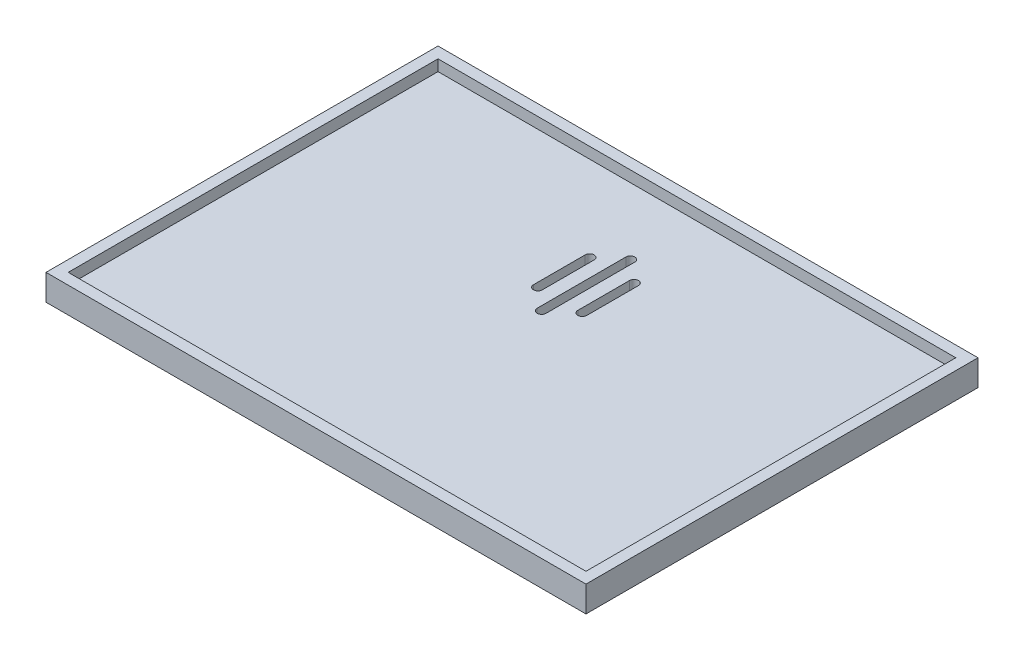
ISO-10303-21;
HEADER;
FILE_DESCRIPTION(('STEP AP214'),'2;1');
FILE_NAME('part.step','',(''),(''),'','','');
FILE_SCHEMA(('AUTOMOTIVE_DESIGN { 1 0 10303 214 1 1 1 1 }'));
ENDSEC;
DATA;
#1=APPLICATION_CONTEXT('core data for automotive mechanical design processes');
#2=APPLICATION_PROTOCOL_DEFINITION('international standard','automotive_design',2000,#1);
#3=PRODUCT_CONTEXT('',#1,'mechanical');
#4=PRODUCT('Part','Part','',(#3));
#5=PRODUCT_RELATED_PRODUCT_CATEGORY('part','',(#4));
#6=PRODUCT_DEFINITION_FORMATION('','',#4);
#7=PRODUCT_DEFINITION_CONTEXT('part definition',#1,'design');
#8=PRODUCT_DEFINITION('design','',#6,#7);
#9=PRODUCT_DEFINITION_SHAPE('','',#8);
#10=(LENGTH_UNIT() NAMED_UNIT(*) SI_UNIT(.MILLI.,.METRE.));
#11=(NAMED_UNIT(*) PLANE_ANGLE_UNIT() SI_UNIT($,.RADIAN.));
#12=(NAMED_UNIT(*) SI_UNIT($,.STERADIAN.) SOLID_ANGLE_UNIT());
#13=UNCERTAINTY_MEASURE_WITH_UNIT(LENGTH_MEASURE(1.E-05),#10,'distance_accuracy_value','');
#14=(GEOMETRIC_REPRESENTATION_CONTEXT(3) GLOBAL_UNCERTAINTY_ASSIGNED_CONTEXT((#13)) GLOBAL_UNIT_ASSIGNED_CONTEXT((#10,
#11,#12)) REPRESENTATION_CONTEXT('',''));
#15=CARTESIAN_POINT('',(0.,0.,0.));
#16=DIRECTION('',(0.,0.,1.));
#17=DIRECTION('',(1.,0.,0.));
#18=AXIS2_PLACEMENT_3D('',#15,#16,#17);
#19=CARTESIAN_POINT('',(-36.5,2.,-26.5));
#20=DIRECTION('',(1.,0.,0.));
#21=DIRECTION('',(0.,0.,-1.));
#22=AXIS2_PLACEMENT_3D('',#19,#20,#21);
#23=PLANE('',#22);
#24=DIRECTION('',(0.,0.,1.));
#25=VECTOR('',#24,1.);
#26=CARTESIAN_POINT('',(-36.5,0.,-26.5));
#27=LINE('',#26,#25);
#28=CARTESIAN_POINT('',(-36.5,0.,-26.5));
#29=VERTEX_POINT('',#28);
#30=CARTESIAN_POINT('',(-36.5,0.,26.5));
#31=VERTEX_POINT('',#30);
#32=EDGE_CURVE('E326',#29,#31,#27,.T.);
#33=ORIENTED_EDGE('',*,*,#32,.T.);
#34=DIRECTION('',(0.,-1.,0.));
#35=VECTOR('',#34,1.);
#36=CARTESIAN_POINT('',(-36.5,2.,26.5));
#37=LINE('',#36,#35);
#38=CARTESIAN_POINT('',(-36.5,3.5,26.5));
#39=VERTEX_POINT('',#38);
#40=EDGE_CURVE('E351',#39,#31,#37,.T.);
#41=ORIENTED_EDGE('',*,*,#40,.F.);
#42=DIRECTION('',(0.,0.,1.));
#43=VECTOR('',#42,1.);
#44=CARTESIAN_POINT('',(-36.5,3.5,-26.5));
#45=LINE('',#44,#43);
#46=CARTESIAN_POINT('',(-36.5,3.5,-26.5));
#47=VERTEX_POINT('',#46);
#48=EDGE_CURVE('E310',#47,#39,#45,.T.);
#49=ORIENTED_EDGE('',*,*,#48,.F.);
#50=DIRECTION('',(0.,-1.,0.));
#51=VECTOR('',#50,1.);
#52=CARTESIAN_POINT('',(-36.5,2.,-26.5));
#53=LINE('',#52,#51);
#54=EDGE_CURVE('E339',#47,#29,#53,.T.);
#55=ORIENTED_EDGE('',*,*,#54,.T.);
#56=EDGE_LOOP('',(#33,#41,#49,#55));
#57=FACE_BOUND('',#56,.T.);
#58=ADVANCED_FACE('F39',(#57),#23,.F.);
#59=CARTESIAN_POINT('',(-36.5,2.,26.5));
#60=DIRECTION('',(0.,0.,-1.));
#61=DIRECTION('',(-1.,0.,0.));
#62=AXIS2_PLACEMENT_3D('',#59,#60,#61);
#63=PLANE('',#62);
#64=DIRECTION('',(1.,0.,0.));
#65=VECTOR('',#64,1.);
#66=CARTESIAN_POINT('',(-36.5,0.,26.5));
#67=LINE('',#66,#65);
#68=CARTESIAN_POINT('',(36.5,0.,26.5));
#69=VERTEX_POINT('',#68);
#70=EDGE_CURVE('E330',#31,#69,#67,.T.);
#71=ORIENTED_EDGE('',*,*,#70,.T.);
#72=DIRECTION('',(0.,-1.,0.));
#73=VECTOR('',#72,1.);
#74=CARTESIAN_POINT('',(36.5,2.,26.5));
#75=LINE('',#74,#73);
#76=CARTESIAN_POINT('',(36.5,3.5,26.5));
#77=VERTEX_POINT('',#76);
#78=EDGE_CURVE('E347',#77,#69,#75,.T.);
#79=ORIENTED_EDGE('',*,*,#78,.F.);
#80=DIRECTION('',(1.,0.,0.));
#81=VECTOR('',#80,1.);
#82=CARTESIAN_POINT('',(-36.5,3.5,26.5));
#83=LINE('',#82,#81);
#84=EDGE_CURVE('E314',#39,#77,#83,.T.);
#85=ORIENTED_EDGE('',*,*,#84,.F.);
#86=ORIENTED_EDGE('',*,*,#40,.T.);
#87=EDGE_LOOP('',(#71,#79,#85,#86));
#88=FACE_BOUND('',#87,.T.);
#89=ADVANCED_FACE('F422',(#88),#63,.F.);
#90=CARTESIAN_POINT('',(36.5,2.,-26.5));
#91=DIRECTION('',(-1.,0.,0.));
#92=DIRECTION('',(0.,0.,1.));
#93=AXIS2_PLACEMENT_3D('',#90,#91,#92);
#94=PLANE('',#93);
#95=DIRECTION('',(0.,0.,-1.));
#96=VECTOR('',#95,1.);
#97=CARTESIAN_POINT('',(36.5,0.,-26.5));
#98=LINE('',#97,#96);
#99=CARTESIAN_POINT('',(36.5,0.,-26.5));
#100=VERTEX_POINT('',#99);
#101=EDGE_CURVE('E333',#69,#100,#98,.T.);
#102=ORIENTED_EDGE('',*,*,#101,.T.);
#103=DIRECTION('',(0.,-1.,0.));
#104=VECTOR('',#103,1.);
#105=CARTESIAN_POINT('',(36.5,2.,-26.5));
#106=LINE('',#105,#104);
#107=CARTESIAN_POINT('',(36.5,3.5,-26.5));
#108=VERTEX_POINT('',#107);
#109=EDGE_CURVE('E343',#108,#100,#106,.T.);
#110=ORIENTED_EDGE('',*,*,#109,.F.);
#111=DIRECTION('',(0.,0.,-1.));
#112=VECTOR('',#111,1.);
#113=CARTESIAN_POINT('',(36.5,3.5,-26.5));
#114=LINE('',#113,#112);
#115=EDGE_CURVE('E318',#77,#108,#114,.T.);
#116=ORIENTED_EDGE('',*,*,#115,.F.);
#117=ORIENTED_EDGE('',*,*,#78,.T.);
#118=EDGE_LOOP('',(#102,#110,#116,#117));
#119=FACE_BOUND('',#118,.T.);
#120=ADVANCED_FACE('F417',(#119),#94,.F.);
#121=CARTESIAN_POINT('',(-36.5,2.,-26.5));
#122=DIRECTION('',(0.,0.,1.));
#123=DIRECTION('',(1.,0.,0.));
#124=AXIS2_PLACEMENT_3D('',#121,#122,#123);
#125=PLANE('',#124);
#126=DIRECTION('',(-1.,0.,0.));
#127=VECTOR('',#126,1.);
#128=CARTESIAN_POINT('',(-36.5,0.,-26.5));
#129=LINE('',#128,#127);
#130=EDGE_CURVE('E336',#100,#29,#129,.T.);
#131=ORIENTED_EDGE('',*,*,#130,.T.);
#132=ORIENTED_EDGE('',*,*,#54,.F.);
#133=DIRECTION('',(-1.,0.,0.));
#134=VECTOR('',#133,1.);
#135=CARTESIAN_POINT('',(-36.5,3.5,-26.5));
#136=LINE('',#135,#134);
#137=EDGE_CURVE('E322',#108,#47,#136,.T.);
#138=ORIENTED_EDGE('',*,*,#137,.F.);
#139=ORIENTED_EDGE('',*,*,#109,.T.);
#140=EDGE_LOOP('',(#131,#132,#138,#139));
#141=FACE_BOUND('',#140,.T.);
#142=ADVANCED_FACE('F408',(#141),#125,.F.);
#143=CARTESIAN_POINT('',(0.,0.,0.));
#144=DIRECTION('',(0.,1.,0.));
#145=DIRECTION('',(0.,0.,1.));
#146=AXIS2_PLACEMENT_3D('',#143,#144,#145);
#147=PLANE('',#146);
#148=DIRECTION('',(0.,0.,-1.));
#149=VECTOR('',#148,1.);
#150=CARTESIAN_POINT('',(-3.6,0.,-6.5));
#151=LINE('',#150,#149);
#152=CARTESIAN_POINT('',(-3.6,0.,-6.5));
#153=VERTEX_POINT('',#152);
#154=CARTESIAN_POINT('',(-3.6,0.,-13.5));
#155=VERTEX_POINT('',#154);
#156=EDGE_CURVE('E218',#153,#155,#151,.T.);
#157=ORIENTED_EDGE('',*,*,#156,.F.);
#158=CARTESIAN_POINT('',(-3.,0.,-6.5));
#159=DIRECTION('',(0.,-1.,0.));
#160=DIRECTION('',(0.,0.,-1.));
#161=AXIS2_PLACEMENT_3D('',#158,#159,#160);
#162=CIRCLE('',#161,0.599999999999999);
#163=CARTESIAN_POINT('',(-2.4,0.,-6.5));
#164=VERTEX_POINT('',#163);
#165=EDGE_CURVE('E54',#164,#153,#162,.T.);
#166=ORIENTED_EDGE('',*,*,#165,.F.);
#167=DIRECTION('',(0.,0.,1.));
#168=VECTOR('',#167,1.);
#169=CARTESIAN_POINT('',(-2.4,0.,-6.5));
#170=LINE('',#169,#168);
#171=CARTESIAN_POINT('',(-2.4,0.,-13.5));
#172=VERTEX_POINT('',#171);
#173=EDGE_CURVE('E226',#172,#164,#170,.T.);
#174=ORIENTED_EDGE('',*,*,#173,.F.);
#175=CARTESIAN_POINT('',(-3.,0.,-13.5));
#176=DIRECTION('',(0.,-1.,0.));
#177=DIRECTION('',(0.,0.,-1.));
#178=AXIS2_PLACEMENT_3D('',#175,#176,#177);
#179=CIRCLE('',#178,0.599999999999999);
#180=EDGE_CURVE('E222',#155,#172,#179,.T.);
#181=ORIENTED_EDGE('',*,*,#180,.F.);
#182=EDGE_LOOP('',(#157,#166,#174,#181));
#183=FACE_BOUND('',#182,.T.);
#184=DIRECTION('',(0.,0.,-1.));
#185=VECTOR('',#184,1.);
#186=CARTESIAN_POINT('',(2.4,0.,-6.5));
#187=LINE('',#186,#185);
#188=CARTESIAN_POINT('',(2.4,0.,-6.5));
#189=VERTEX_POINT('',#188);
#190=CARTESIAN_POINT('',(2.4,0.,-13.5));
#191=VERTEX_POINT('',#190);
#192=EDGE_CURVE('E193',#189,#191,#187,.T.);
#193=ORIENTED_EDGE('',*,*,#192,.F.);
#194=CARTESIAN_POINT('',(3.,0.,-6.5));
#195=DIRECTION('',(0.,-1.,0.));
#196=DIRECTION('',(0.,0.,-1.));
#197=AXIS2_PLACEMENT_3D('',#194,#195,#196);
#198=CIRCLE('',#197,0.6);
#199=CARTESIAN_POINT('',(3.6,0.,-6.5));
#200=VERTEX_POINT('',#199);
#201=EDGE_CURVE('E62',#200,#189,#198,.T.);
#202=ORIENTED_EDGE('',*,*,#201,.F.);
#203=DIRECTION('',(0.,0.,1.));
#204=VECTOR('',#203,1.);
#205=CARTESIAN_POINT('',(3.6,0.,-6.5));
#206=LINE('',#205,#204);
#207=CARTESIAN_POINT('',(3.6,0.,-13.5));
#208=VERTEX_POINT('',#207);
#209=EDGE_CURVE('E201',#208,#200,#206,.T.);
#210=ORIENTED_EDGE('',*,*,#209,.F.);
#211=CARTESIAN_POINT('',(3.,0.,-13.5));
#212=DIRECTION('',(0.,-1.,0.));
#213=DIRECTION('',(0.,0.,-1.));
#214=AXIS2_PLACEMENT_3D('',#211,#212,#213);
#215=CIRCLE('',#214,0.6);
#216=EDGE_CURVE('E182',#191,#208,#215,.T.);
#217=ORIENTED_EDGE('',*,*,#216,.F.);
#218=EDGE_LOOP('',(#193,#202,#210,#217));
#219=FACE_BOUND('',#218,.T.);
#220=DIRECTION('',(0.,0.,-1.));
#221=VECTOR('',#220,1.);
#222=CARTESIAN_POINT('',(-0.599999999999999,0.,-4.));
#223=LINE('',#222,#221);
#224=CARTESIAN_POINT('',(-0.599999999999999,0.,-4.));
#225=VERTEX_POINT('',#224);
#226=CARTESIAN_POINT('',(-0.599999999999999,0.,-16.));
#227=VERTEX_POINT('',#226);
#228=EDGE_CURVE('E244',#225,#227,#223,.T.);
#229=ORIENTED_EDGE('',*,*,#228,.F.);
#230=CARTESIAN_POINT('',(0.,0.,-4.));
#231=DIRECTION('',(0.,-1.,0.));
#232=DIRECTION('',(0.,0.,-1.));
#233=AXIS2_PLACEMENT_3D('',#230,#231,#232);
#234=CIRCLE('',#233,0.6);
#235=CARTESIAN_POINT('',(0.600000000000002,0.,-4.));
#236=VERTEX_POINT('',#235);
#237=EDGE_CURVE('E211',#236,#225,#234,.T.);
#238=ORIENTED_EDGE('',*,*,#237,.F.);
#239=DIRECTION('',(0.,0.,1.));
#240=VECTOR('',#239,1.);
#241=CARTESIAN_POINT('',(0.600000000000002,0.,-4.));
#242=LINE('',#241,#240);
#243=CARTESIAN_POINT('',(0.600000000000002,0.,-16.));
#244=VERTEX_POINT('',#243);
#245=EDGE_CURVE('E252',#244,#236,#242,.T.);
#246=ORIENTED_EDGE('',*,*,#245,.F.);
#247=CARTESIAN_POINT('',(0.,0.,-16.));
#248=DIRECTION('',(0.,-1.,0.));
#249=DIRECTION('',(0.,0.,-1.));
#250=AXIS2_PLACEMENT_3D('',#247,#248,#249);
#251=CIRCLE('',#250,0.6);
#252=EDGE_CURVE('E248',#227,#244,#251,.T.);
#253=ORIENTED_EDGE('',*,*,#252,.F.);
#254=EDGE_LOOP('',(#229,#238,#246,#253));
#255=FACE_BOUND('',#254,.T.);
#256=ORIENTED_EDGE('',*,*,#32,.F.);
#257=ORIENTED_EDGE('',*,*,#130,.F.);
#258=ORIENTED_EDGE('',*,*,#101,.F.);
#259=ORIENTED_EDGE('',*,*,#70,.F.);
#260=EDGE_LOOP('',(#256,#257,#258,#259));
#261=FACE_BOUND('',#260,.T.);
#262=ADVANCED_FACE('F198',(#183,#219,#255,#261),#147,.F.);
#263=CARTESIAN_POINT('',(0.,3.5,0.));
#264=DIRECTION('',(0.,1.,0.));
#265=DIRECTION('',(0.,0.,1.));
#266=AXIS2_PLACEMENT_3D('',#263,#264,#265);
#267=PLANE('',#266);
#268=ORIENTED_EDGE('',*,*,#48,.T.);
#269=ORIENTED_EDGE('',*,*,#84,.T.);
#270=ORIENTED_EDGE('',*,*,#115,.T.);
#271=ORIENTED_EDGE('',*,*,#137,.T.);
#272=EDGE_LOOP('',(#268,#269,#270,#271));
#273=FACE_BOUND('',#272,.T.);
#274=DIRECTION('',(1.,0.,0.));
#275=VECTOR('',#274,1.);
#276=CARTESIAN_POINT('',(-35.,3.5,25.));
#277=LINE('',#276,#275);
#278=CARTESIAN_POINT('',(-35.,3.5,25.));
#279=VERTEX_POINT('',#278);
#280=CARTESIAN_POINT('',(35.,3.5,25.));
#281=VERTEX_POINT('',#280);
#282=EDGE_CURVE('E273',#279,#281,#277,.T.);
#283=ORIENTED_EDGE('',*,*,#282,.F.);
#284=DIRECTION('',(0.,0.,1.));
#285=VECTOR('',#284,1.);
#286=CARTESIAN_POINT('',(-35.,3.5,-25.));
#287=LINE('',#286,#285);
#288=CARTESIAN_POINT('',(-35.,3.5,-25.));
#289=VERTEX_POINT('',#288);
#290=EDGE_CURVE('E270',#289,#279,#287,.T.);
#291=ORIENTED_EDGE('',*,*,#290,.F.);
#292=DIRECTION('',(-1.,0.,0.));
#293=VECTOR('',#292,1.);
#294=CARTESIAN_POINT('',(-35.,3.5,-25.));
#295=LINE('',#294,#293);
#296=CARTESIAN_POINT('',(35.,3.5,-25.));
#297=VERTEX_POINT('',#296);
#298=EDGE_CURVE('E281',#297,#289,#295,.T.);
#299=ORIENTED_EDGE('',*,*,#298,.F.);
#300=DIRECTION('',(0.,0.,-1.));
#301=VECTOR('',#300,1.);
#302=CARTESIAN_POINT('',(35.,3.5,-25.));
#303=LINE('',#302,#301);
#304=EDGE_CURVE('E277',#281,#297,#303,.T.);
#305=ORIENTED_EDGE('',*,*,#304,.F.);
#306=EDGE_LOOP('',(#283,#291,#299,#305));
#307=FACE_BOUND('',#306,.T.);
#308=ADVANCED_FACE('F407',(#273,#307),#267,.T.);
#309=CARTESIAN_POINT('',(-35.,3.5,-25.));
#310=DIRECTION('',(1.,0.,0.));
#311=DIRECTION('',(0.,0.,-1.));
#312=AXIS2_PLACEMENT_3D('',#309,#310,#311);
#313=PLANE('',#312);
#314=DIRECTION('',(0.,0.,1.));
#315=VECTOR('',#314,1.);
#316=CARTESIAN_POINT('',(-35.,2.,-25.));
#317=LINE('',#316,#315);
#318=CARTESIAN_POINT('',(-35.,2.,-25.));
#319=VERTEX_POINT('',#318);
#320=CARTESIAN_POINT('',(-35.,2.,25.));
#321=VERTEX_POINT('',#320);
#322=EDGE_CURVE('E260',#319,#321,#317,.T.);
#323=ORIENTED_EDGE('',*,*,#322,.F.);
#324=DIRECTION('',(0.,-1.,0.));
#325=VECTOR('',#324,1.);
#326=CARTESIAN_POINT('',(-35.,3.5,-25.));
#327=LINE('',#326,#325);
#328=EDGE_CURVE('E284',#289,#319,#327,.T.);
#329=ORIENTED_EDGE('',*,*,#328,.F.);
#330=ORIENTED_EDGE('',*,*,#290,.T.);
#331=DIRECTION('',(0.,-1.,0.));
#332=VECTOR('',#331,1.);
#333=CARTESIAN_POINT('',(-35.,3.5,25.));
#334=LINE('',#333,#332);
#335=EDGE_CURVE('E306',#279,#321,#334,.T.);
#336=ORIENTED_EDGE('',*,*,#335,.T.);
#337=EDGE_LOOP('',(#323,#329,#330,#336));
#338=FACE_BOUND('',#337,.T.);
#339=ADVANCED_FACE('F414',(#338),#313,.T.);
#340=CARTESIAN_POINT('',(-35.,3.5,25.));
#341=DIRECTION('',(0.,0.,-1.));
#342=DIRECTION('',(-1.,0.,0.));
#343=AXIS2_PLACEMENT_3D('',#340,#341,#342);
#344=PLANE('',#343);
#345=DIRECTION('',(1.,0.,0.));
#346=VECTOR('',#345,1.);
#347=CARTESIAN_POINT('',(-35.,2.,25.));
#348=LINE('',#347,#346);
#349=CARTESIAN_POINT('',(35.,2.,25.));
#350=VERTEX_POINT('',#349);
#351=EDGE_CURVE('E287',#321,#350,#348,.T.);
#352=ORIENTED_EDGE('',*,*,#351,.F.);
#353=ORIENTED_EDGE('',*,*,#335,.F.);
#354=ORIENTED_EDGE('',*,*,#282,.T.);
#355=DIRECTION('',(0.,-1.,0.));
#356=VECTOR('',#355,1.);
#357=CARTESIAN_POINT('',(35.,3.5,25.));
#358=LINE('',#357,#356);
#359=EDGE_CURVE('E302',#281,#350,#358,.T.);
#360=ORIENTED_EDGE('',*,*,#359,.T.);
#361=EDGE_LOOP('',(#352,#353,#354,#360));
#362=FACE_BOUND('',#361,.T.);
#363=ADVANCED_FACE('F464',(#362),#344,.T.);
#364=CARTESIAN_POINT('',(35.,3.5,-25.));
#365=DIRECTION('',(-1.,0.,0.));
#366=DIRECTION('',(0.,0.,1.));
#367=AXIS2_PLACEMENT_3D('',#364,#365,#366);
#368=PLANE('',#367);
#369=DIRECTION('',(0.,0.,-1.));
#370=VECTOR('',#369,1.);
#371=CARTESIAN_POINT('',(35.,2.,-25.));
#372=LINE('',#371,#370);
#373=CARTESIAN_POINT('',(35.,2.,-25.));
#374=VERTEX_POINT('',#373);
#375=EDGE_CURVE('E290',#350,#374,#372,.T.);
#376=ORIENTED_EDGE('',*,*,#375,.F.);
#377=ORIENTED_EDGE('',*,*,#359,.F.);
#378=ORIENTED_EDGE('',*,*,#304,.T.);
#379=DIRECTION('',(0.,-1.,0.));
#380=VECTOR('',#379,1.);
#381=CARTESIAN_POINT('',(35.,3.5,-25.));
#382=LINE('',#381,#380);
#383=EDGE_CURVE('E298',#297,#374,#382,.T.);
#384=ORIENTED_EDGE('',*,*,#383,.T.);
#385=EDGE_LOOP('',(#376,#377,#378,#384));
#386=FACE_BOUND('',#385,.T.);
#387=ADVANCED_FACE('F474',(#386),#368,.T.);
#388=CARTESIAN_POINT('',(-35.,3.5,-25.));
#389=DIRECTION('',(0.,0.,1.));
#390=DIRECTION('',(1.,0.,0.));
#391=AXIS2_PLACEMENT_3D('',#388,#389,#390);
#392=PLANE('',#391);
#393=DIRECTION('',(-1.,0.,0.));
#394=VECTOR('',#393,1.);
#395=CARTESIAN_POINT('',(-35.,2.,-25.));
#396=LINE('',#395,#394);
#397=EDGE_CURVE('E274',#374,#319,#396,.T.);
#398=ORIENTED_EDGE('',*,*,#397,.F.);
#399=ORIENTED_EDGE('',*,*,#383,.F.);
#400=ORIENTED_EDGE('',*,*,#298,.T.);
#401=ORIENTED_EDGE('',*,*,#328,.T.);
#402=EDGE_LOOP('',(#398,#399,#400,#401));
#403=FACE_BOUND('',#402,.T.);
#404=ADVANCED_FACE('F484',(#403),#392,.T.);
#405=CARTESIAN_POINT('',(0.,2.,0.));
#406=DIRECTION('',(0.,1.,0.));
#407=DIRECTION('',(0.,0.,1.));
#408=AXIS2_PLACEMENT_3D('',#405,#406,#407);
#409=PLANE('',#408);
#410=CARTESIAN_POINT('',(-3.,2.,-6.5));
#411=DIRECTION('',(0.,1.,0.));
#412=DIRECTION('',(0.,0.,1.));
#413=AXIS2_PLACEMENT_3D('',#410,#411,#412);
#414=CIRCLE('',#413,0.599999999999999);
#415=CARTESIAN_POINT('',(-3.6,2.,-6.5));
#416=VERTEX_POINT('',#415);
#417=CARTESIAN_POINT('',(-2.4,2.,-6.5));
#418=VERTEX_POINT('',#417);
#419=EDGE_CURVE('E11',#416,#418,#414,.T.);
#420=ORIENTED_EDGE('',*,*,#419,.F.);
#421=DIRECTION('',(0.,0.,1.));
#422=VECTOR('',#421,1.);
#423=CARTESIAN_POINT('',(-3.6,2.,0.));
#424=LINE('',#423,#422);
#425=CARTESIAN_POINT('',(-3.6,2.,-13.5));
#426=VERTEX_POINT('',#425);
#427=EDGE_CURVE('E379',#426,#416,#424,.T.);
#428=ORIENTED_EDGE('',*,*,#427,.F.);
#429=CARTESIAN_POINT('',(-3.,2.,-13.5));
#430=DIRECTION('',(0.,1.,0.));
#431=DIRECTION('',(0.,0.,1.));
#432=AXIS2_PLACEMENT_3D('',#429,#430,#431);
#433=CIRCLE('',#432,0.599999999999999);
#434=CARTESIAN_POINT('',(-2.4,2.,-13.5));
#435=VERTEX_POINT('',#434);
#436=EDGE_CURVE('E382',#435,#426,#433,.T.);
#437=ORIENTED_EDGE('',*,*,#436,.F.);
#438=DIRECTION('',(0.,0.,-1.));
#439=VECTOR('',#438,1.);
#440=CARTESIAN_POINT('',(-2.4,2.,0.));
#441=LINE('',#440,#439);
#442=EDGE_CURVE('E47',#418,#435,#441,.T.);
#443=ORIENTED_EDGE('',*,*,#442,.F.);
#444=EDGE_LOOP('',(#420,#428,#437,#443));
#445=FACE_BOUND('',#444,.T.);
#446=CARTESIAN_POINT('',(3.,2.,-6.5));
#447=DIRECTION('',(0.,1.,0.));
#448=DIRECTION('',(0.,0.,1.));
#449=AXIS2_PLACEMENT_3D('',#446,#447,#448);
#450=CIRCLE('',#449,0.6);
#451=CARTESIAN_POINT('',(2.4,2.,-6.5));
#452=VERTEX_POINT('',#451);
#453=CARTESIAN_POINT('',(3.6,2.,-6.5));
#454=VERTEX_POINT('',#453);
#455=EDGE_CURVE('E376',#452,#454,#450,.T.);
#456=ORIENTED_EDGE('',*,*,#455,.F.);
#457=DIRECTION('',(0.,0.,1.));
#458=VECTOR('',#457,1.);
#459=CARTESIAN_POINT('',(2.4,2.,0.));
#460=LINE('',#459,#458);
#461=CARTESIAN_POINT('',(2.4,2.,-13.5));
#462=VERTEX_POINT('',#461);
#463=EDGE_CURVE('E368',#462,#452,#460,.T.);
#464=ORIENTED_EDGE('',*,*,#463,.F.);
#465=CARTESIAN_POINT('',(3.,2.,-13.5));
#466=DIRECTION('',(0.,1.,0.));
#467=DIRECTION('',(0.,0.,1.));
#468=AXIS2_PLACEMENT_3D('',#465,#466,#467);
#469=CIRCLE('',#468,0.6);
#470=CARTESIAN_POINT('',(3.6,2.,-13.5));
#471=VERTEX_POINT('',#470);
#472=EDGE_CURVE('E185',#471,#462,#469,.T.);
#473=ORIENTED_EDGE('',*,*,#472,.F.);
#474=DIRECTION('',(0.,0.,-1.));
#475=VECTOR('',#474,1.);
#476=CARTESIAN_POINT('',(3.6,2.,0.));
#477=LINE('',#476,#475);
#478=EDGE_CURVE('E373',#454,#471,#477,.T.);
#479=ORIENTED_EDGE('',*,*,#478,.F.);
#480=EDGE_LOOP('',(#456,#464,#473,#479));
#481=FACE_BOUND('',#480,.T.);
#482=CARTESIAN_POINT('',(0.,2.,-4.));
#483=DIRECTION('',(0.,1.,0.));
#484=DIRECTION('',(0.,0.,1.));
#485=AXIS2_PLACEMENT_3D('',#482,#483,#484);
#486=CIRCLE('',#485,0.6);
#487=CARTESIAN_POINT('',(-0.599999999999999,2.,-4.));
#488=VERTEX_POINT('',#487);
#489=CARTESIAN_POINT('',(0.600000000000002,2.,-4.));
#490=VERTEX_POINT('',#489);
#491=EDGE_CURVE('E365',#488,#490,#486,.T.);
#492=ORIENTED_EDGE('',*,*,#491,.F.);
#493=DIRECTION('',(0.,0.,1.));
#494=VECTOR('',#493,1.);
#495=CARTESIAN_POINT('',(-0.599999999999999,2.,0.));
#496=LINE('',#495,#494);
#497=CARTESIAN_POINT('',(-0.599999999999999,2.,-16.));
#498=VERTEX_POINT('',#497);
#499=EDGE_CURVE('E355',#498,#488,#496,.T.);
#500=ORIENTED_EDGE('',*,*,#499,.F.);
#501=CARTESIAN_POINT('',(0.,2.,-16.));
#502=DIRECTION('',(0.,1.,0.));
#503=DIRECTION('',(0.,0.,1.));
#504=AXIS2_PLACEMENT_3D('',#501,#502,#503);
#505=CIRCLE('',#504,0.6);
#506=CARTESIAN_POINT('',(0.600000000000002,2.,-16.));
#507=VERTEX_POINT('',#506);
#508=EDGE_CURVE('E358',#507,#498,#505,.T.);
#509=ORIENTED_EDGE('',*,*,#508,.F.);
#510=DIRECTION('',(0.,0.,-1.));
#511=VECTOR('',#510,1.);
#512=CARTESIAN_POINT('',(0.600000000000002,2.,0.));
#513=LINE('',#512,#511);
#514=EDGE_CURVE('E362',#490,#507,#513,.T.);
#515=ORIENTED_EDGE('',*,*,#514,.F.);
#516=EDGE_LOOP('',(#492,#500,#509,#515));
#517=FACE_BOUND('',#516,.T.);
#518=ORIENTED_EDGE('',*,*,#322,.T.);
#519=ORIENTED_EDGE('',*,*,#351,.T.);
#520=ORIENTED_EDGE('',*,*,#375,.T.);
#521=ORIENTED_EDGE('',*,*,#397,.T.);
#522=EDGE_LOOP('',(#518,#519,#520,#521));
#523=FACE_BOUND('',#522,.T.);
#524=ADVANCED_FACE('F399',(#445,#481,#517,#523),#409,.T.);
#525=CARTESIAN_POINT('',(0.,3.5,-4.));
#526=DIRECTION('',(0.,-1.,0.));
#527=DIRECTION('',(0.,0.,-1.));
#528=AXIS2_PLACEMENT_3D('',#525,#526,#527);
#529=CYLINDRICAL_SURFACE('',#528,0.6);
#530=ORIENTED_EDGE('',*,*,#491,.T.);
#531=DIRECTION('',(0.,-1.,0.));
#532=VECTOR('',#531,1.);
#533=CARTESIAN_POINT('',(0.600000000000002,3.5,-4.));
#534=LINE('',#533,#532);
#535=EDGE_CURVE('E257',#490,#236,#534,.T.);
#536=ORIENTED_EDGE('',*,*,#535,.T.);
#537=ORIENTED_EDGE('',*,*,#237,.T.);
#538=DIRECTION('',(0.,-1.,0.));
#539=VECTOR('',#538,1.);
#540=CARTESIAN_POINT('',(-0.599999999999999,3.5,-4.));
#541=LINE('',#540,#539);
#542=EDGE_CURVE('E256',#488,#225,#541,.T.);
#543=ORIENTED_EDGE('',*,*,#542,.F.);
#544=EDGE_LOOP('',(#530,#536,#537,#543));
#545=FACE_BOUND('',#544,.T.);
#546=ADVANCED_FACE('F509',(#545),#529,.F.);
#547=CARTESIAN_POINT('',(0.600000000000002,3.5,-4.));
#548=DIRECTION('',(1.,0.,0.));
#549=DIRECTION('',(0.,0.,-1.));
#550=AXIS2_PLACEMENT_3D('',#547,#548,#549);
#551=PLANE('',#550);
#552=ORIENTED_EDGE('',*,*,#514,.T.);
#553=DIRECTION('',(0.,-1.,0.));
#554=VECTOR('',#553,1.);
#555=CARTESIAN_POINT('',(0.600000000000002,3.5,-16.));
#556=LINE('',#555,#554);
#557=EDGE_CURVE('E261',#507,#244,#556,.T.);
#558=ORIENTED_EDGE('',*,*,#557,.T.);
#559=ORIENTED_EDGE('',*,*,#245,.T.);
#560=ORIENTED_EDGE('',*,*,#535,.F.);
#561=EDGE_LOOP('',(#552,#558,#559,#560));
#562=FACE_BOUND('',#561,.T.);
#563=ADVANCED_FACE('F516',(#562),#551,.F.);
#564=CARTESIAN_POINT('',(0.,3.5,-16.));
#565=DIRECTION('',(0.,-1.,0.));
#566=DIRECTION('',(0.,0.,-1.));
#567=AXIS2_PLACEMENT_3D('',#564,#565,#566);
#568=CYLINDRICAL_SURFACE('',#567,0.6);
#569=ORIENTED_EDGE('',*,*,#508,.T.);
#570=DIRECTION('',(0.,-1.,0.));
#571=VECTOR('',#570,1.);
#572=CARTESIAN_POINT('',(-0.599999999999999,3.5,-16.));
#573=LINE('',#572,#571);
#574=EDGE_CURVE('E264',#498,#227,#573,.T.);
#575=ORIENTED_EDGE('',*,*,#574,.T.);
#576=ORIENTED_EDGE('',*,*,#252,.T.);
#577=ORIENTED_EDGE('',*,*,#557,.F.);
#578=EDGE_LOOP('',(#569,#575,#576,#577));
#579=FACE_BOUND('',#578,.T.);
#580=ADVANCED_FACE('F526',(#579),#568,.F.);
#581=CARTESIAN_POINT('',(-0.599999999999999,3.5,-4.));
#582=DIRECTION('',(-1.,0.,0.));
#583=DIRECTION('',(0.,0.,1.));
#584=AXIS2_PLACEMENT_3D('',#581,#582,#583);
#585=PLANE('',#584);
#586=ORIENTED_EDGE('',*,*,#499,.T.);
#587=ORIENTED_EDGE('',*,*,#542,.T.);
#588=ORIENTED_EDGE('',*,*,#228,.T.);
#589=ORIENTED_EDGE('',*,*,#574,.F.);
#590=EDGE_LOOP('',(#586,#587,#588,#589));
#591=FACE_BOUND('',#590,.T.);
#592=ADVANCED_FACE('F536',(#591),#585,.F.);
#593=CARTESIAN_POINT('',(3.,3.5,-6.5));
#594=DIRECTION('',(0.,-1.,0.));
#595=DIRECTION('',(0.,0.,-1.));
#596=AXIS2_PLACEMENT_3D('',#593,#594,#595);
#597=CYLINDRICAL_SURFACE('',#596,0.6);
#598=ORIENTED_EDGE('',*,*,#455,.T.);
#599=DIRECTION('',(0.,-1.,0.));
#600=VECTOR('',#599,1.);
#601=CARTESIAN_POINT('',(3.6,3.5,-6.5));
#602=LINE('',#601,#600);
#603=EDGE_CURVE('E208',#454,#200,#602,.T.);
#604=ORIENTED_EDGE('',*,*,#603,.T.);
#605=ORIENTED_EDGE('',*,*,#201,.T.);
#606=DIRECTION('',(0.,-1.,0.));
#607=VECTOR('',#606,1.);
#608=CARTESIAN_POINT('',(2.4,3.5,-6.5));
#609=LINE('',#608,#607);
#610=EDGE_CURVE('E190',#452,#189,#609,.T.);
#611=ORIENTED_EDGE('',*,*,#610,.F.);
#612=EDGE_LOOP('',(#598,#604,#605,#611));
#613=FACE_BOUND('',#612,.T.);
#614=ADVANCED_FACE('F546',(#613),#597,.F.);
#615=CARTESIAN_POINT('',(3.6,3.5,-6.5));
#616=DIRECTION('',(1.,0.,0.));
#617=DIRECTION('',(0.,0.,-1.));
#618=AXIS2_PLACEMENT_3D('',#615,#616,#617);
#619=PLANE('',#618);
#620=ORIENTED_EDGE('',*,*,#478,.T.);
#621=DIRECTION('',(0.,-1.,0.));
#622=VECTOR('',#621,1.);
#623=CARTESIAN_POINT('',(3.6,3.5,-13.5));
#624=LINE('',#623,#622);
#625=EDGE_CURVE('E189',#471,#208,#624,.T.);
#626=ORIENTED_EDGE('',*,*,#625,.T.);
#627=ORIENTED_EDGE('',*,*,#209,.T.);
#628=ORIENTED_EDGE('',*,*,#603,.F.);
#629=EDGE_LOOP('',(#620,#626,#627,#628));
#630=FACE_BOUND('',#629,.T.);
#631=ADVANCED_FACE('F556',(#630),#619,.F.);
#632=CARTESIAN_POINT('',(3.,3.5,-13.5));
#633=DIRECTION('',(0.,-1.,0.));
#634=DIRECTION('',(0.,0.,-1.));
#635=AXIS2_PLACEMENT_3D('',#632,#633,#634);
#636=CYLINDRICAL_SURFACE('',#635,0.6);
#637=ORIENTED_EDGE('',*,*,#472,.T.);
#638=DIRECTION('',(0.,-1.,0.));
#639=VECTOR('',#638,1.);
#640=CARTESIAN_POINT('',(2.4,3.5,-13.5));
#641=LINE('',#640,#639);
#642=EDGE_CURVE('E177',#462,#191,#641,.T.);
#643=ORIENTED_EDGE('',*,*,#642,.T.);
#644=ORIENTED_EDGE('',*,*,#216,.T.);
#645=ORIENTED_EDGE('',*,*,#625,.F.);
#646=EDGE_LOOP('',(#637,#643,#644,#645));
#647=FACE_BOUND('',#646,.T.);
#648=ADVANCED_FACE('F179',(#647),#636,.F.);
#649=CARTESIAN_POINT('',(2.4,3.5,-6.5));
#650=DIRECTION('',(-1.,0.,0.));
#651=DIRECTION('',(0.,0.,1.));
#652=AXIS2_PLACEMENT_3D('',#649,#650,#651);
#653=PLANE('',#652);
#654=ORIENTED_EDGE('',*,*,#463,.T.);
#655=ORIENTED_EDGE('',*,*,#610,.T.);
#656=ORIENTED_EDGE('',*,*,#192,.T.);
#657=ORIENTED_EDGE('',*,*,#642,.F.);
#658=EDGE_LOOP('',(#654,#655,#656,#657));
#659=FACE_BOUND('',#658,.T.);
#660=ADVANCED_FACE('F194',(#659),#653,.F.);
#661=CARTESIAN_POINT('',(-3.,3.5,-6.5));
#662=DIRECTION('',(0.,-1.,0.));
#663=DIRECTION('',(0.,0.,-1.));
#664=AXIS2_PLACEMENT_3D('',#661,#662,#663);
#665=CYLINDRICAL_SURFACE('',#664,0.599999999999999);
#666=ORIENTED_EDGE('',*,*,#419,.T.);
#667=DIRECTION('',(0.,-1.,0.));
#668=VECTOR('',#667,1.);
#669=CARTESIAN_POINT('',(-2.4,3.5,-6.5));
#670=LINE('',#669,#668);
#671=EDGE_CURVE('E231',#418,#164,#670,.T.);
#672=ORIENTED_EDGE('',*,*,#671,.T.);
#673=ORIENTED_EDGE('',*,*,#165,.T.);
#674=DIRECTION('',(0.,-1.,0.));
#675=VECTOR('',#674,1.);
#676=CARTESIAN_POINT('',(-3.6,3.5,-6.5));
#677=LINE('',#676,#675);
#678=EDGE_CURVE('E230',#416,#153,#677,.T.);
#679=ORIENTED_EDGE('',*,*,#678,.F.);
#680=EDGE_LOOP('',(#666,#672,#673,#679));
#681=FACE_BOUND('',#680,.T.);
#682=ADVANCED_FACE('F404',(#681),#665,.F.);
#683=CARTESIAN_POINT('',(-2.4,3.5,-6.5));
#684=DIRECTION('',(1.,0.,0.));
#685=DIRECTION('',(0.,0.,-1.));
#686=AXIS2_PLACEMENT_3D('',#683,#684,#685);
#687=PLANE('',#686);
#688=ORIENTED_EDGE('',*,*,#442,.T.);
#689=DIRECTION('',(0.,-1.,0.));
#690=VECTOR('',#689,1.);
#691=CARTESIAN_POINT('',(-2.4,3.5,-13.5));
#692=LINE('',#691,#690);
#693=EDGE_CURVE('E234',#435,#172,#692,.T.);
#694=ORIENTED_EDGE('',*,*,#693,.T.);
#695=ORIENTED_EDGE('',*,*,#173,.T.);
#696=ORIENTED_EDGE('',*,*,#671,.F.);
#697=EDGE_LOOP('',(#688,#694,#695,#696));
#698=FACE_BOUND('',#697,.T.);
#699=ADVANCED_FACE('F390',(#698),#687,.F.);
#700=CARTESIAN_POINT('',(-3.,3.5,-13.5));
#701=DIRECTION('',(0.,-1.,0.));
#702=DIRECTION('',(0.,0.,-1.));
#703=AXIS2_PLACEMENT_3D('',#700,#701,#702);
#704=CYLINDRICAL_SURFACE('',#703,0.599999999999999);
#705=ORIENTED_EDGE('',*,*,#436,.T.);
#706=DIRECTION('',(0.,-1.,0.));
#707=VECTOR('',#706,1.);
#708=CARTESIAN_POINT('',(-3.6,3.5,-13.5));
#709=LINE('',#708,#707);
#710=EDGE_CURVE('E237',#426,#155,#709,.T.);
#711=ORIENTED_EDGE('',*,*,#710,.T.);
#712=ORIENTED_EDGE('',*,*,#180,.T.);
#713=ORIENTED_EDGE('',*,*,#693,.F.);
#714=EDGE_LOOP('',(#705,#711,#712,#713));
#715=FACE_BOUND('',#714,.T.);
#716=ADVANCED_FACE('F395',(#715),#704,.F.);
#717=CARTESIAN_POINT('',(-3.6,3.5,-6.5));
#718=DIRECTION('',(-1.,0.,0.));
#719=DIRECTION('',(0.,0.,1.));
#720=AXIS2_PLACEMENT_3D('',#717,#718,#719);
#721=PLANE('',#720);
#722=ORIENTED_EDGE('',*,*,#427,.T.);
#723=ORIENTED_EDGE('',*,*,#678,.T.);
#724=ORIENTED_EDGE('',*,*,#156,.T.);
#725=ORIENTED_EDGE('',*,*,#710,.F.);
#726=EDGE_LOOP('',(#722,#723,#724,#725));
#727=FACE_BOUND('',#726,.T.);
#728=ADVANCED_FACE('F402',(#727),#721,.F.);
#729=CLOSED_SHELL('',(#58,#89,#120,#142,#262,#308,#339,#363,#387,#404,#524,#546,#563,#580,#592,
#614,#631,#648,#660,#682,#699,#716,#728));
#730=MANIFOLD_SOLID_BREP('B2',#729);
#731=ADVANCED_BREP_SHAPE_REPRESENTATION('',(#18,#730),#14);
#732=SHAPE_DEFINITION_REPRESENTATION(#9,#731);
ENDSEC;
END-ISO-10303-21;
